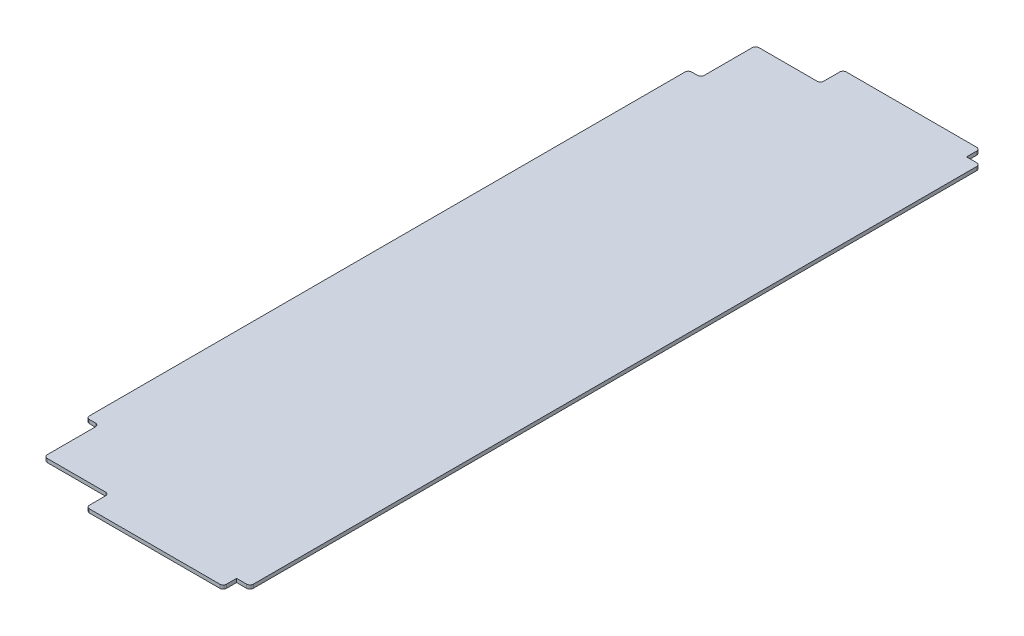
ISO-10303-21;
HEADER;
FILE_DESCRIPTION(('STEP AP214'),'2;1');
FILE_NAME('part.step','',(''),(''),'','','');
FILE_SCHEMA(('AUTOMOTIVE_DESIGN { 1 0 10303 214 1 1 1 1 }'));
ENDSEC;
DATA;
#1=APPLICATION_CONTEXT('core data for automotive mechanical design processes');
#2=APPLICATION_PROTOCOL_DEFINITION('international standard','automotive_design',2000,#1);
#3=PRODUCT_CONTEXT('',#1,'mechanical');
#4=PRODUCT('Part','Part','',(#3));
#5=PRODUCT_RELATED_PRODUCT_CATEGORY('part','',(#4));
#6=PRODUCT_DEFINITION_FORMATION('','',#4);
#7=PRODUCT_DEFINITION_CONTEXT('part definition',#1,'design');
#8=PRODUCT_DEFINITION('design','',#6,#7);
#9=PRODUCT_DEFINITION_SHAPE('','',#8);
#10=(LENGTH_UNIT() NAMED_UNIT(*) SI_UNIT(.MILLI.,.METRE.));
#11=(NAMED_UNIT(*) PLANE_ANGLE_UNIT() SI_UNIT($,.RADIAN.));
#12=(NAMED_UNIT(*) SI_UNIT($,.STERADIAN.) SOLID_ANGLE_UNIT());
#13=UNCERTAINTY_MEASURE_WITH_UNIT(LENGTH_MEASURE(1.E-05),#10,'distance_accuracy_value','');
#14=(GEOMETRIC_REPRESENTATION_CONTEXT(3) GLOBAL_UNCERTAINTY_ASSIGNED_CONTEXT((#13)) GLOBAL_UNIT_ASSIGNED_CONTEXT((#10,
#11,#12)) REPRESENTATION_CONTEXT('',''));
#15=CARTESIAN_POINT('',(0.,0.,0.));
#16=DIRECTION('',(0.,0.,1.));
#17=DIRECTION('',(1.,0.,0.));
#18=AXIS2_PLACEMENT_3D('',#15,#16,#17);
#19=CARTESIAN_POINT('',(190.5,2.778125,0.));
#20=DIRECTION('',(-1.,0.,0.));
#21=DIRECTION('',(0.,0.,1.));
#22=AXIS2_PLACEMENT_3D('',#19,#20,#21);
#23=PLANE('',#22);
#24=DIRECTION('',(0.,0.,-1.));
#25=VECTOR('',#24,1.);
#26=CARTESIAN_POINT('',(190.5,2.778125,0.));
#27=LINE('',#26,#25);
#28=CARTESIAN_POINT('',(190.5,2.778125,-30.48));
#29=VERTEX_POINT('',#28);
#30=CARTESIAN_POINT('',(190.5,2.778125,-579.12));
#31=VERTEX_POINT('',#30);
#32=EDGE_CURVE('E336',#29,#31,#27,.T.);
#33=ORIENTED_EDGE('',*,*,#32,.F.);
#34=DIRECTION('',(0.,1.,0.));
#35=VECTOR('',#34,1.);
#36=CARTESIAN_POINT('',(190.5,2.778125,-30.48));
#37=LINE('',#36,#35);
#38=CARTESIAN_POINT('',(190.5,0.,-30.48));
#39=VERTEX_POINT('',#38);
#40=EDGE_CURVE('E376',#29,#39,#37,.F.);
#41=ORIENTED_EDGE('',*,*,#40,.T.);
#42=DIRECTION('',(0.,0.,-1.));
#43=VECTOR('',#42,1.);
#44=CARTESIAN_POINT('',(190.5,0.,0.));
#45=LINE('',#44,#43);
#46=CARTESIAN_POINT('',(190.5,0.,-579.12));
#47=VERTEX_POINT('',#46);
#48=EDGE_CURVE('E327',#39,#47,#45,.T.);
#49=ORIENTED_EDGE('',*,*,#48,.T.);
#50=DIRECTION('',(0.,1.,0.));
#51=VECTOR('',#50,1.);
#52=CARTESIAN_POINT('',(190.5,2.778125,-579.12));
#53=LINE('',#52,#51);
#54=EDGE_CURVE('E373',#47,#31,#53,.T.);
#55=ORIENTED_EDGE('',*,*,#54,.T.);
#56=EDGE_LOOP('',(#33,#41,#49,#55));
#57=FACE_BOUND('',#56,.T.);
#58=ADVANCED_FACE('F32',(#57),#23,.F.);
#59=CARTESIAN_POINT('',(0.,2.778125,0.));
#60=DIRECTION('',(0.,-1.,0.));
#61=DIRECTION('',(0.,0.,-1.));
#62=AXIS2_PLACEMENT_3D('',#59,#60,#61);
#63=PLANE('',#62);
#64=DIRECTION('',(-1.,0.,0.));
#65=VECTOR('',#64,1.);
#66=CARTESIAN_POINT('',(190.5,2.778125,-27.94));
#67=LINE('',#66,#65);
#68=CARTESIAN_POINT('',(187.96,2.778125,-27.94));
#69=VERTEX_POINT('',#68);
#70=CARTESIAN_POINT('',(180.34,2.778125,-27.94));
#71=VERTEX_POINT('',#70);
#72=EDGE_CURVE('E247',#69,#71,#67,.T.);
#73=ORIENTED_EDGE('',*,*,#72,.F.);
#74=CARTESIAN_POINT('',(187.96,2.778125,-30.48));
#75=DIRECTION('',(0.,-1.,0.));
#76=DIRECTION('',(0.,0.,-1.));
#77=AXIS2_PLACEMENT_3D('',#74,#75,#76);
#78=CIRCLE('',#77,2.54);
#79=EDGE_CURVE('E371',#69,#29,#78,.F.);
#80=ORIENTED_EDGE('',*,*,#79,.T.);
#81=ORIENTED_EDGE('',*,*,#32,.T.);
#82=CARTESIAN_POINT('',(187.96,2.778125,-579.12));
#83=DIRECTION('',(0.,-1.,0.));
#84=DIRECTION('',(0.,0.,-1.));
#85=AXIS2_PLACEMENT_3D('',#82,#83,#84);
#86=CIRCLE('',#85,2.54);
#87=CARTESIAN_POINT('',(187.96,2.778125,-581.66));
#88=VERTEX_POINT('',#87);
#89=EDGE_CURVE('E365',#31,#88,#86,.F.);
#90=ORIENTED_EDGE('',*,*,#89,.T.);
#91=DIRECTION('',(1.,0.,0.));
#92=VECTOR('',#91,1.);
#93=CARTESIAN_POINT('',(190.5,2.778125,-581.66));
#94=LINE('',#93,#92);
#95=CARTESIAN_POINT('',(180.34,2.778125,-581.66));
#96=VERTEX_POINT('',#95);
#97=EDGE_CURVE('E286',#96,#88,#94,.T.);
#98=ORIENTED_EDGE('',*,*,#97,.F.);
#99=DIRECTION('',(0.,0.,1.));
#100=VECTOR('',#99,1.);
#101=CARTESIAN_POINT('',(180.34,2.778125,-591.82));
#102=LINE('',#101,#100);
#103=CARTESIAN_POINT('',(180.34,2.778125,-589.28));
#104=VERTEX_POINT('',#103);
#105=EDGE_CURVE('E251',#104,#96,#102,.T.);
#106=ORIENTED_EDGE('',*,*,#105,.F.);
#107=CARTESIAN_POINT('',(177.8,2.778125,-589.28));
#108=DIRECTION('',(0.,-1.,0.));
#109=DIRECTION('',(0.,0.,-1.));
#110=AXIS2_PLACEMENT_3D('',#107,#108,#109);
#111=CIRCLE('',#110,2.54);
#112=CARTESIAN_POINT('',(177.8,2.778125,-591.82));
#113=VERTEX_POINT('',#112);
#114=EDGE_CURVE('E367',#104,#113,#111,.F.);
#115=ORIENTED_EDGE('',*,*,#114,.T.);
#116=DIRECTION('',(1.,0.,0.));
#117=VECTOR('',#116,1.);
#118=CARTESIAN_POINT('',(0.,2.778125,-591.82));
#119=LINE('',#118,#117);
#120=CARTESIAN_POINT('',(78.994,2.778125,-591.82));
#121=VERTEX_POINT('',#120);
#122=EDGE_CURVE('E321',#121,#113,#119,.T.);
#123=ORIENTED_EDGE('',*,*,#122,.F.);
#124=CARTESIAN_POINT('',(78.994,2.778125,-589.28));
#125=DIRECTION('',(0.,-1.,0.));
#126=DIRECTION('',(0.,0.,-1.));
#127=AXIS2_PLACEMENT_3D('',#124,#125,#126);
#128=CIRCLE('',#127,2.54);
#129=CARTESIAN_POINT('',(76.454,2.778125,-589.28));
#130=VERTEX_POINT('',#129);
#131=EDGE_CURVE('E355',#121,#130,#128,.F.);
#132=ORIENTED_EDGE('',*,*,#131,.T.);
#133=DIRECTION('',(0.,0.,-1.));
#134=VECTOR('',#133,1.);
#135=CARTESIAN_POINT('',(76.454,2.778125,-591.82));
#136=LINE('',#135,#134);
#137=CARTESIAN_POINT('',(76.454,2.778125,-577.215));
#138=VERTEX_POINT('',#137);
#139=EDGE_CURVE('E298',#138,#130,#136,.T.);
#140=ORIENTED_EDGE('',*,*,#139,.F.);
#141=CARTESIAN_POINT('',(73.914,2.778125,-577.215));
#142=DIRECTION('',(0.,-1.,0.));
#143=DIRECTION('',(0.,0.,-1.));
#144=AXIS2_PLACEMENT_3D('',#141,#142,#143);
#145=CIRCLE('',#144,2.54);
#146=CARTESIAN_POINT('',(73.914,2.778125,-574.675));
#147=VERTEX_POINT('',#146);
#148=EDGE_CURVE('E40',#138,#147,#145,.T.);
#149=ORIENTED_EDGE('',*,*,#148,.T.);
#150=DIRECTION('',(1.,0.,0.));
#151=VECTOR('',#150,1.);
#152=CARTESIAN_POINT('',(76.454,2.778125,-574.675));
#153=LINE('',#152,#151);
#154=CARTESIAN_POINT('',(29.845,2.778125,-574.675));
#155=VERTEX_POINT('',#154);
#156=EDGE_CURVE('E313',#155,#147,#153,.T.);
#157=ORIENTED_EDGE('',*,*,#156,.F.);
#158=CARTESIAN_POINT('',(29.845,2.778125,-572.135));
#159=DIRECTION('',(0.,-1.,0.));
#160=DIRECTION('',(0.,0.,-1.));
#161=AXIS2_PLACEMENT_3D('',#158,#159,#160);
#162=CIRCLE('',#161,2.54);
#163=CARTESIAN_POINT('',(27.305,2.778125,-572.135));
#164=VERTEX_POINT('',#163);
#165=EDGE_CURVE('E353',#155,#164,#162,.F.);
#166=ORIENTED_EDGE('',*,*,#165,.T.);
#167=DIRECTION('',(0.,0.,-1.));
#168=VECTOR('',#167,1.);
#169=CARTESIAN_POINT('',(27.305,2.778125,-574.675));
#170=LINE('',#169,#168);
#171=CARTESIAN_POINT('',(27.305,2.778125,-535.686));
#172=VERTEX_POINT('',#171);
#173=EDGE_CURVE('E310',#172,#164,#170,.T.);
#174=ORIENTED_EDGE('',*,*,#173,.F.);
#175=CARTESIAN_POINT('',(24.765,2.778125,-535.686));
#176=DIRECTION('',(0.,-1.,0.));
#177=DIRECTION('',(0.,0.,-1.));
#178=AXIS2_PLACEMENT_3D('',#175,#176,#177);
#179=CIRCLE('',#178,2.54);
#180=CARTESIAN_POINT('',(24.765,2.778125,-533.146));
#181=VERTEX_POINT('',#180);
#182=EDGE_CURVE('E446',#172,#181,#179,.T.);
#183=ORIENTED_EDGE('',*,*,#182,.T.);
#184=DIRECTION('',(1.,0.,0.));
#185=VECTOR('',#184,1.);
#186=CARTESIAN_POINT('',(27.305,2.778125,-533.146));
#187=LINE('',#186,#185);
#188=CARTESIAN_POINT('',(20.32,2.778125,-533.146));
#189=VERTEX_POINT('',#188);
#190=EDGE_CURVE('E271',#189,#181,#187,.T.);
#191=ORIENTED_EDGE('',*,*,#190,.F.);
#192=CARTESIAN_POINT('',(20.32,2.778125,-530.606));
#193=DIRECTION('',(0.,-1.,0.));
#194=DIRECTION('',(0.,0.,-1.));
#195=AXIS2_PLACEMENT_3D('',#192,#193,#194);
#196=CIRCLE('',#195,2.54);
#197=CARTESIAN_POINT('',(17.78,2.778125,-530.606));
#198=VERTEX_POINT('',#197);
#199=EDGE_CURVE('E357',#189,#198,#196,.F.);
#200=ORIENTED_EDGE('',*,*,#199,.T.);
#201=DIRECTION('',(0.,0.,-1.));
#202=VECTOR('',#201,1.);
#203=CARTESIAN_POINT('',(17.78,2.778125,-591.82));
#204=LINE('',#203,#202);
#205=CARTESIAN_POINT('',(17.78,2.778125,-78.994));
#206=VERTEX_POINT('',#205);
#207=EDGE_CURVE('E307',#206,#198,#204,.T.);
#208=ORIENTED_EDGE('',*,*,#207,.F.);
#209=CARTESIAN_POINT('',(20.32,2.778125,-78.994));
#210=DIRECTION('',(0.,-1.,0.));
#211=DIRECTION('',(0.,0.,-1.));
#212=AXIS2_PLACEMENT_3D('',#209,#210,#211);
#213=CIRCLE('',#212,2.54);
#214=CARTESIAN_POINT('',(20.32,2.778125,-76.454));
#215=VERTEX_POINT('',#214);
#216=EDGE_CURVE('E359',#206,#215,#213,.F.);
#217=ORIENTED_EDGE('',*,*,#216,.T.);
#218=DIRECTION('',(-1.,0.,0.));
#219=VECTOR('',#218,1.);
#220=CARTESIAN_POINT('',(27.3050000000001,2.778125,-76.454));
#221=LINE('',#220,#219);
#222=CARTESIAN_POINT('',(24.7650000000001,2.778125,-76.454));
#223=VERTEX_POINT('',#222);
#224=EDGE_CURVE('E264',#223,#215,#221,.T.);
#225=ORIENTED_EDGE('',*,*,#224,.F.);
#226=CARTESIAN_POINT('',(24.7650000000001,2.778125,-73.914));
#227=DIRECTION('',(0.,-1.,0.));
#228=DIRECTION('',(0.,0.,-1.));
#229=AXIS2_PLACEMENT_3D('',#226,#227,#228);
#230=CIRCLE('',#229,2.54);
#231=CARTESIAN_POINT('',(27.3050000000001,2.778125,-73.914));
#232=VERTEX_POINT('',#231);
#233=EDGE_CURVE('E454',#223,#232,#230,.T.);
#234=ORIENTED_EDGE('',*,*,#233,.T.);
#235=DIRECTION('',(0.,0.,-1.));
#236=VECTOR('',#235,1.);
#237=CARTESIAN_POINT('',(27.3050000000001,2.778125,-34.925));
#238=LINE('',#237,#236);
#239=CARTESIAN_POINT('',(27.3050000000001,2.778125,-37.465));
#240=VERTEX_POINT('',#239);
#241=EDGE_CURVE('E279',#240,#232,#238,.T.);
#242=ORIENTED_EDGE('',*,*,#241,.F.);
#243=CARTESIAN_POINT('',(29.8450000000001,2.778125,-37.465));
#244=DIRECTION('',(0.,-1.,0.));
#245=DIRECTION('',(0.,0.,-1.));
#246=AXIS2_PLACEMENT_3D('',#243,#244,#245);
#247=CIRCLE('',#246,2.54);
#248=CARTESIAN_POINT('',(29.8450000000001,2.778125,-34.925));
#249=VERTEX_POINT('',#248);
#250=EDGE_CURVE('E361',#240,#249,#247,.F.);
#251=ORIENTED_EDGE('',*,*,#250,.T.);
#252=DIRECTION('',(-1.,0.,0.));
#253=VECTOR('',#252,1.);
#254=CARTESIAN_POINT('',(76.454,2.778125,-34.925));
#255=LINE('',#254,#253);
#256=CARTESIAN_POINT('',(73.914,2.778125,-34.925));
#257=VERTEX_POINT('',#256);
#258=EDGE_CURVE('E275',#257,#249,#255,.T.);
#259=ORIENTED_EDGE('',*,*,#258,.F.);
#260=CARTESIAN_POINT('',(73.914,2.778125,-32.385));
#261=DIRECTION('',(0.,-1.,0.));
#262=DIRECTION('',(0.,0.,-1.));
#263=AXIS2_PLACEMENT_3D('',#260,#261,#262);
#264=CIRCLE('',#263,2.54);
#265=CARTESIAN_POINT('',(76.454,2.778125,-32.385));
#266=VERTEX_POINT('',#265);
#267=EDGE_CURVE('E450',#257,#266,#264,.T.);
#268=ORIENTED_EDGE('',*,*,#267,.T.);
#269=DIRECTION('',(0.,0.,-1.));
#270=VECTOR('',#269,1.);
#271=CARTESIAN_POINT('',(76.454,2.778125,-17.78));
#272=LINE('',#271,#270);
#273=CARTESIAN_POINT('',(76.454,2.778125,-20.32));
#274=VERTEX_POINT('',#273);
#275=EDGE_CURVE('E272',#274,#266,#272,.T.);
#276=ORIENTED_EDGE('',*,*,#275,.F.);
#277=CARTESIAN_POINT('',(78.994,2.778125,-20.32));
#278=DIRECTION('',(0.,-1.,0.));
#279=DIRECTION('',(0.,0.,-1.));
#280=AXIS2_PLACEMENT_3D('',#277,#278,#279);
#281=CIRCLE('',#280,2.54);
#282=CARTESIAN_POINT('',(78.994,2.778125,-17.78));
#283=VERTEX_POINT('',#282);
#284=EDGE_CURVE('E363',#274,#283,#281,.F.);
#285=ORIENTED_EDGE('',*,*,#284,.T.);
#286=DIRECTION('',(-1.,0.,0.));
#287=VECTOR('',#286,1.);
#288=CARTESIAN_POINT('',(0.,2.778125,-17.78));
#289=LINE('',#288,#287);
#290=CARTESIAN_POINT('',(177.8,2.778125,-17.78));
#291=VERTEX_POINT('',#290);
#292=EDGE_CURVE('E328',#291,#283,#289,.T.);
#293=ORIENTED_EDGE('',*,*,#292,.F.);
#294=CARTESIAN_POINT('',(177.8,2.778125,-20.32));
#295=DIRECTION('',(0.,-1.,0.));
#296=DIRECTION('',(0.,0.,-1.));
#297=AXIS2_PLACEMENT_3D('',#294,#295,#296);
#298=CIRCLE('',#297,2.54);
#299=CARTESIAN_POINT('',(180.34,2.778125,-20.32));
#300=VERTEX_POINT('',#299);
#301=EDGE_CURVE('E369',#291,#300,#298,.F.);
#302=ORIENTED_EDGE('',*,*,#301,.T.);
#303=DIRECTION('',(0.,0.,1.));
#304=VECTOR('',#303,1.);
#305=CARTESIAN_POINT('',(180.34,2.778125,-17.78));
#306=LINE('',#305,#304);
#307=EDGE_CURVE('E241',#71,#300,#306,.T.);
#308=ORIENTED_EDGE('',*,*,#307,.F.);
#309=EDGE_LOOP('',(#73,#80,#81,#90,#98,#106,#115,#123,#132,#140,#149,#157,#166,#174,#183,#191,
#200,#208,#217,#225,#234,#242,#251,#259,#268,#276,#285,#293,#302,#308));
#310=FACE_BOUND('',#309,.T.);
#311=ADVANCED_FACE('F460',(#310),#63,.F.);
#312=CARTESIAN_POINT('',(0.,0.,0.));
#313=DIRECTION('',(0.,-1.,0.));
#314=DIRECTION('',(0.,0.,-1.));
#315=AXIS2_PLACEMENT_3D('',#312,#313,#314);
#316=PLANE('',#315);
#317=ORIENTED_EDGE('',*,*,#48,.F.);
#318=CARTESIAN_POINT('',(187.96,0.,-30.48));
#319=DIRECTION('',(0.,-1.,0.));
#320=DIRECTION('',(0.,0.,-1.));
#321=AXIS2_PLACEMENT_3D('',#318,#319,#320);
#322=CIRCLE('',#321,2.54);
#323=CARTESIAN_POINT('',(187.96,0.,-27.94));
#324=VERTEX_POINT('',#323);
#325=EDGE_CURVE('E237',#39,#324,#322,.T.);
#326=ORIENTED_EDGE('',*,*,#325,.T.);
#327=DIRECTION('',(-1.,0.,0.));
#328=VECTOR('',#327,1.);
#329=CARTESIAN_POINT('',(190.5,0.,-27.94));
#330=LINE('',#329,#328);
#331=CARTESIAN_POINT('',(180.34,0.,-27.94));
#332=VERTEX_POINT('',#331);
#333=EDGE_CURVE('E229',#324,#332,#330,.T.);
#334=ORIENTED_EDGE('',*,*,#333,.T.);
#335=DIRECTION('',(0.,0.,1.));
#336=VECTOR('',#335,1.);
#337=CARTESIAN_POINT('',(180.34,0.,-17.78));
#338=LINE('',#337,#336);
#339=CARTESIAN_POINT('',(180.34,0.,-20.32));
#340=VERTEX_POINT('',#339);
#341=EDGE_CURVE('E234',#332,#340,#338,.T.);
#342=ORIENTED_EDGE('',*,*,#341,.T.);
#343=CARTESIAN_POINT('',(177.8,0.,-20.32));
#344=DIRECTION('',(0.,-1.,0.));
#345=DIRECTION('',(0.,0.,-1.));
#346=AXIS2_PLACEMENT_3D('',#343,#344,#345);
#347=CIRCLE('',#346,2.54);
#348=CARTESIAN_POINT('',(177.8,0.,-17.78));
#349=VERTEX_POINT('',#348);
#350=EDGE_CURVE('E393',#340,#349,#347,.T.);
#351=ORIENTED_EDGE('',*,*,#350,.T.);
#352=DIRECTION('',(-1.,0.,0.));
#353=VECTOR('',#352,1.);
#354=CARTESIAN_POINT('',(0.,0.,-17.78));
#355=LINE('',#354,#353);
#356=CARTESIAN_POINT('',(78.994,0.,-17.78));
#357=VERTEX_POINT('',#356);
#358=EDGE_CURVE('E324',#349,#357,#355,.T.);
#359=ORIENTED_EDGE('',*,*,#358,.T.);
#360=CARTESIAN_POINT('',(78.994,0.,-20.32));
#361=DIRECTION('',(0.,-1.,0.));
#362=DIRECTION('',(0.,0.,-1.));
#363=AXIS2_PLACEMENT_3D('',#360,#361,#362);
#364=CIRCLE('',#363,2.54);
#365=CARTESIAN_POINT('',(76.454,0.,-20.32));
#366=VERTEX_POINT('',#365);
#367=EDGE_CURVE('E387',#357,#366,#364,.T.);
#368=ORIENTED_EDGE('',*,*,#367,.T.);
#369=DIRECTION('',(0.,0.,-1.));
#370=VECTOR('',#369,1.);
#371=CARTESIAN_POINT('',(76.454,0.,-17.78));
#372=LINE('',#371,#370);
#373=CARTESIAN_POINT('',(76.454,0.,-32.385));
#374=VERTEX_POINT('',#373);
#375=EDGE_CURVE('E260',#366,#374,#372,.T.);
#376=ORIENTED_EDGE('',*,*,#375,.T.);
#377=CARTESIAN_POINT('',(73.914,0.,-32.385));
#378=DIRECTION('',(0.,-1.,0.));
#379=DIRECTION('',(0.,0.,-1.));
#380=AXIS2_PLACEMENT_3D('',#377,#378,#379);
#381=CIRCLE('',#380,2.54);
#382=CARTESIAN_POINT('',(73.914,0.,-34.925));
#383=VERTEX_POINT('',#382);
#384=EDGE_CURVE('E452',#374,#383,#381,.F.);
#385=ORIENTED_EDGE('',*,*,#384,.T.);
#386=DIRECTION('',(-1.,0.,0.));
#387=VECTOR('',#386,1.);
#388=CARTESIAN_POINT('',(76.454,0.,-34.925));
#389=LINE('',#388,#387);
#390=CARTESIAN_POINT('',(29.8450000000001,0.,-34.925));
#391=VERTEX_POINT('',#390);
#392=EDGE_CURVE('E263',#383,#391,#389,.T.);
#393=ORIENTED_EDGE('',*,*,#392,.T.);
#394=CARTESIAN_POINT('',(29.8450000000001,0.,-37.465));
#395=DIRECTION('',(0.,-1.,0.));
#396=DIRECTION('',(0.,0.,-1.));
#397=AXIS2_PLACEMENT_3D('',#394,#395,#396);
#398=CIRCLE('',#397,2.54);
#399=CARTESIAN_POINT('',(27.3050000000001,0.,-37.465));
#400=VERTEX_POINT('',#399);
#401=EDGE_CURVE('E54',#391,#400,#398,.T.);
#402=ORIENTED_EDGE('',*,*,#401,.T.);
#403=DIRECTION('',(0.,0.,-1.));
#404=VECTOR('',#403,1.);
#405=CARTESIAN_POINT('',(27.3050000000001,0.,-34.925));
#406=LINE('',#405,#404);
#407=CARTESIAN_POINT('',(27.3050000000001,0.,-73.914));
#408=VERTEX_POINT('',#407);
#409=EDGE_CURVE('E266',#400,#408,#406,.T.);
#410=ORIENTED_EDGE('',*,*,#409,.T.);
#411=CARTESIAN_POINT('',(24.7650000000001,0.,-73.914));
#412=DIRECTION('',(0.,-1.,0.));
#413=DIRECTION('',(0.,0.,-1.));
#414=AXIS2_PLACEMENT_3D('',#411,#412,#413);
#415=CIRCLE('',#414,2.54);
#416=CARTESIAN_POINT('',(24.7650000000001,0.,-76.454));
#417=VERTEX_POINT('',#416);
#418=EDGE_CURVE('E456',#408,#417,#415,.F.);
#419=ORIENTED_EDGE('',*,*,#418,.T.);
#420=DIRECTION('',(-1.,0.,0.));
#421=VECTOR('',#420,1.);
#422=CARTESIAN_POINT('',(27.3050000000001,0.,-76.454));
#423=LINE('',#422,#421);
#424=CARTESIAN_POINT('',(20.32,0.,-76.454));
#425=VERTEX_POINT('',#424);
#426=EDGE_CURVE('E268',#417,#425,#423,.T.);
#427=ORIENTED_EDGE('',*,*,#426,.T.);
#428=CARTESIAN_POINT('',(20.32,0.,-78.994));
#429=DIRECTION('',(0.,-1.,0.));
#430=DIRECTION('',(0.,0.,-1.));
#431=AXIS2_PLACEMENT_3D('',#428,#429,#430);
#432=CIRCLE('',#431,2.54);
#433=CARTESIAN_POINT('',(17.78,0.,-78.994));
#434=VERTEX_POINT('',#433);
#435=EDGE_CURVE('E384',#425,#434,#432,.T.);
#436=ORIENTED_EDGE('',*,*,#435,.T.);
#437=DIRECTION('',(0.,0.,-1.));
#438=VECTOR('',#437,1.);
#439=CARTESIAN_POINT('',(17.78,0.,-591.82));
#440=LINE('',#439,#438);
#441=CARTESIAN_POINT('',(17.78,0.,-530.606));
#442=VERTEX_POINT('',#441);
#443=EDGE_CURVE('E318',#434,#442,#440,.T.);
#444=ORIENTED_EDGE('',*,*,#443,.T.);
#445=CARTESIAN_POINT('',(20.32,0.,-530.606));
#446=DIRECTION('',(0.,-1.,0.));
#447=DIRECTION('',(0.,0.,-1.));
#448=AXIS2_PLACEMENT_3D('',#445,#446,#447);
#449=CIRCLE('',#448,2.54);
#450=CARTESIAN_POINT('',(20.32,0.,-533.146));
#451=VERTEX_POINT('',#450);
#452=EDGE_CURVE('E382',#442,#451,#449,.T.);
#453=ORIENTED_EDGE('',*,*,#452,.T.);
#454=DIRECTION('',(1.,0.,0.));
#455=VECTOR('',#454,1.);
#456=CARTESIAN_POINT('',(27.305,0.,-533.146));
#457=LINE('',#456,#455);
#458=CARTESIAN_POINT('',(24.765,0.,-533.146));
#459=VERTEX_POINT('',#458);
#460=EDGE_CURVE('E294',#451,#459,#457,.T.);
#461=ORIENTED_EDGE('',*,*,#460,.T.);
#462=CARTESIAN_POINT('',(24.765,0.,-535.686));
#463=DIRECTION('',(0.,-1.,0.));
#464=DIRECTION('',(0.,0.,-1.));
#465=AXIS2_PLACEMENT_3D('',#462,#463,#464);
#466=CIRCLE('',#465,2.54);
#467=CARTESIAN_POINT('',(27.305,0.,-535.686));
#468=VERTEX_POINT('',#467);
#469=EDGE_CURVE('E448',#459,#468,#466,.F.);
#470=ORIENTED_EDGE('',*,*,#469,.T.);
#471=DIRECTION('',(0.,0.,-1.));
#472=VECTOR('',#471,1.);
#473=CARTESIAN_POINT('',(27.305,0.,-574.675));
#474=LINE('',#473,#472);
#475=CARTESIAN_POINT('',(27.305,0.,-572.135));
#476=VERTEX_POINT('',#475);
#477=EDGE_CURVE('E297',#468,#476,#474,.T.);
#478=ORIENTED_EDGE('',*,*,#477,.T.);
#479=CARTESIAN_POINT('',(29.845,0.,-572.135));
#480=DIRECTION('',(0.,-1.,0.));
#481=DIRECTION('',(0.,0.,-1.));
#482=AXIS2_PLACEMENT_3D('',#479,#480,#481);
#483=CIRCLE('',#482,2.54);
#484=CARTESIAN_POINT('',(29.845,0.,-574.675));
#485=VERTEX_POINT('',#484);
#486=EDGE_CURVE('E378',#476,#485,#483,.T.);
#487=ORIENTED_EDGE('',*,*,#486,.T.);
#488=DIRECTION('',(1.,0.,0.));
#489=VECTOR('',#488,1.);
#490=CARTESIAN_POINT('',(76.454,0.,-574.675));
#491=LINE('',#490,#489);
#492=CARTESIAN_POINT('',(73.914,0.,-574.675));
#493=VERTEX_POINT('',#492);
#494=EDGE_CURVE('E301',#485,#493,#491,.T.);
#495=ORIENTED_EDGE('',*,*,#494,.T.);
#496=CARTESIAN_POINT('',(73.914,0.,-577.215));
#497=DIRECTION('',(0.,-1.,0.));
#498=DIRECTION('',(0.,0.,-1.));
#499=AXIS2_PLACEMENT_3D('',#496,#497,#498);
#500=CIRCLE('',#499,2.54);
#501=CARTESIAN_POINT('',(76.454,0.,-577.215));
#502=VERTEX_POINT('',#501);
#503=EDGE_CURVE('E11',#493,#502,#500,.F.);
#504=ORIENTED_EDGE('',*,*,#503,.T.);
#505=DIRECTION('',(0.,0.,-1.));
#506=VECTOR('',#505,1.);
#507=CARTESIAN_POINT('',(76.454,0.,-591.82));
#508=LINE('',#507,#506);
#509=CARTESIAN_POINT('',(76.454,0.,-589.28));
#510=VERTEX_POINT('',#509);
#511=EDGE_CURVE('E304',#502,#510,#508,.T.);
#512=ORIENTED_EDGE('',*,*,#511,.T.);
#513=CARTESIAN_POINT('',(78.994,0.,-589.28));
#514=DIRECTION('',(0.,-1.,0.));
#515=DIRECTION('',(0.,0.,-1.));
#516=AXIS2_PLACEMENT_3D('',#513,#514,#515);
#517=CIRCLE('',#516,2.54);
#518=CARTESIAN_POINT('',(78.994,0.,-591.82));
#519=VERTEX_POINT('',#518);
#520=EDGE_CURVE('E380',#510,#519,#517,.T.);
#521=ORIENTED_EDGE('',*,*,#520,.T.);
#522=DIRECTION('',(1.,0.,0.));
#523=VECTOR('',#522,1.);
#524=CARTESIAN_POINT('',(0.,0.,-591.82));
#525=LINE('',#524,#523);
#526=CARTESIAN_POINT('',(177.8,0.,-591.82));
#527=VERTEX_POINT('',#526);
#528=EDGE_CURVE('E331',#519,#527,#525,.T.);
#529=ORIENTED_EDGE('',*,*,#528,.T.);
#530=CARTESIAN_POINT('',(177.8,0.,-589.28));
#531=DIRECTION('',(0.,-1.,0.));
#532=DIRECTION('',(0.,0.,-1.));
#533=AXIS2_PLACEMENT_3D('',#530,#531,#532);
#534=CIRCLE('',#533,2.54);
#535=CARTESIAN_POINT('',(180.34,0.,-589.28));
#536=VERTEX_POINT('',#535);
#537=EDGE_CURVE('E391',#527,#536,#534,.T.);
#538=ORIENTED_EDGE('',*,*,#537,.T.);
#539=DIRECTION('',(0.,0.,1.));
#540=VECTOR('',#539,1.);
#541=CARTESIAN_POINT('',(180.34,0.,-591.82));
#542=LINE('',#541,#540);
#543=CARTESIAN_POINT('',(180.34,0.,-581.66));
#544=VERTEX_POINT('',#543);
#545=EDGE_CURVE('E283',#536,#544,#542,.T.);
#546=ORIENTED_EDGE('',*,*,#545,.T.);
#547=DIRECTION('',(1.,0.,0.));
#548=VECTOR('',#547,1.);
#549=CARTESIAN_POINT('',(190.5,0.,-581.66));
#550=LINE('',#549,#548);
#551=CARTESIAN_POINT('',(187.96,0.,-581.66));
#552=VERTEX_POINT('',#551);
#553=EDGE_CURVE('E285',#544,#552,#550,.T.);
#554=ORIENTED_EDGE('',*,*,#553,.T.);
#555=CARTESIAN_POINT('',(187.96,0.,-579.12));
#556=DIRECTION('',(0.,-1.,0.));
#557=DIRECTION('',(0.,0.,-1.));
#558=AXIS2_PLACEMENT_3D('',#555,#556,#557);
#559=CIRCLE('',#558,2.54);
#560=EDGE_CURVE('E389',#552,#47,#559,.T.);
#561=ORIENTED_EDGE('',*,*,#560,.T.);
#562=EDGE_LOOP('',(#317,#326,#334,#342,#351,#359,#368,#376,#385,#393,#402,#410,#419,#427,#436,
#444,#453,#461,#470,#478,#487,#495,#504,#512,#521,#529,#538,#546,#554,#561));
#563=FACE_BOUND('',#562,.T.);
#564=ADVANCED_FACE('F232',(#563),#316,.T.);
#565=CARTESIAN_POINT('',(0.,0.,-591.82));
#566=DIRECTION('',(0.,0.,1.));
#567=DIRECTION('',(1.,0.,0.));
#568=AXIS2_PLACEMENT_3D('',#565,#566,#567);
#569=PLANE('',#568);
#570=ORIENTED_EDGE('',*,*,#122,.T.);
#571=DIRECTION('',(0.,1.,0.));
#572=VECTOR('',#571,1.);
#573=CARTESIAN_POINT('',(177.8,0.,-591.82));
#574=LINE('',#573,#572);
#575=EDGE_CURVE('E408',#113,#527,#574,.F.);
#576=ORIENTED_EDGE('',*,*,#575,.T.);
#577=ORIENTED_EDGE('',*,*,#528,.F.);
#578=DIRECTION('',(0.,1.,0.));
#579=VECTOR('',#578,1.);
#580=CARTESIAN_POINT('',(78.994,0.,-591.82));
#581=LINE('',#580,#579);
#582=EDGE_CURVE('E405',#519,#121,#581,.T.);
#583=ORIENTED_EDGE('',*,*,#582,.T.);
#584=EDGE_LOOP('',(#570,#576,#577,#583));
#585=FACE_BOUND('',#584,.T.);
#586=ADVANCED_FACE('F481',(#585),#569,.F.);
#587=CARTESIAN_POINT('',(0.,0.,-17.78));
#588=DIRECTION('',(0.,0.,-1.));
#589=DIRECTION('',(-1.,0.,0.));
#590=AXIS2_PLACEMENT_3D('',#587,#588,#589);
#591=PLANE('',#590);
#592=ORIENTED_EDGE('',*,*,#358,.F.);
#593=DIRECTION('',(0.,1.,0.));
#594=VECTOR('',#593,1.);
#595=CARTESIAN_POINT('',(177.8,0.,-17.78));
#596=LINE('',#595,#594);
#597=EDGE_CURVE('E398',#349,#291,#596,.T.);
#598=ORIENTED_EDGE('',*,*,#597,.T.);
#599=ORIENTED_EDGE('',*,*,#292,.T.);
#600=DIRECTION('',(0.,1.,0.));
#601=VECTOR('',#600,1.);
#602=CARTESIAN_POINT('',(78.994,0.,-17.78));
#603=LINE('',#602,#601);
#604=EDGE_CURVE('E396',#283,#357,#603,.F.);
#605=ORIENTED_EDGE('',*,*,#604,.T.);
#606=EDGE_LOOP('',(#592,#598,#599,#605));
#607=FACE_BOUND('',#606,.T.);
#608=ADVANCED_FACE('F529',(#607),#591,.F.);
#609=CARTESIAN_POINT('',(17.78,0.,-591.82));
#610=DIRECTION('',(1.,0.,0.));
#611=DIRECTION('',(0.,0.,-1.));
#612=AXIS2_PLACEMENT_3D('',#609,#610,#611);
#613=PLANE('',#612);
#614=ORIENTED_EDGE('',*,*,#443,.F.);
#615=DIRECTION('',(0.,1.,0.));
#616=VECTOR('',#615,1.);
#617=CARTESIAN_POINT('',(17.78,0.,-78.994));
#618=LINE('',#617,#616);
#619=EDGE_CURVE('E433',#434,#206,#618,.T.);
#620=ORIENTED_EDGE('',*,*,#619,.T.);
#621=ORIENTED_EDGE('',*,*,#207,.T.);
#622=DIRECTION('',(0.,1.,0.));
#623=VECTOR('',#622,1.);
#624=CARTESIAN_POINT('',(17.78,0.,-530.606));
#625=LINE('',#624,#623);
#626=EDGE_CURVE('E431',#198,#442,#625,.F.);
#627=ORIENTED_EDGE('',*,*,#626,.T.);
#628=EDGE_LOOP('',(#614,#620,#621,#627));
#629=FACE_BOUND('',#628,.T.);
#630=ADVANCED_FACE('F532',(#629),#613,.F.);
#631=CARTESIAN_POINT('',(76.454,0.,-591.82));
#632=DIRECTION('',(1.,0.,0.));
#633=DIRECTION('',(0.,0.,-1.));
#634=AXIS2_PLACEMENT_3D('',#631,#632,#633);
#635=PLANE('',#634);
#636=ORIENTED_EDGE('',*,*,#139,.T.);
#637=DIRECTION('',(0.,1.,0.));
#638=VECTOR('',#637,1.);
#639=CARTESIAN_POINT('',(76.454,0.,-589.28));
#640=LINE('',#639,#638);
#641=EDGE_CURVE('E439',#130,#510,#640,.F.);
#642=ORIENTED_EDGE('',*,*,#641,.T.);
#643=ORIENTED_EDGE('',*,*,#511,.F.);
#644=DIRECTION('',(0.,1.,0.));
#645=VECTOR('',#644,1.);
#646=CARTESIAN_POINT('',(76.454,2.778125,-577.215));
#647=LINE('',#646,#645);
#648=EDGE_CURVE('E436',#502,#138,#647,.T.);
#649=ORIENTED_EDGE('',*,*,#648,.T.);
#650=EDGE_LOOP('',(#636,#642,#643,#649));
#651=FACE_BOUND('',#650,.T.);
#652=ADVANCED_FACE('F473',(#651),#635,.F.);
#653=CARTESIAN_POINT('',(76.454,0.,-574.675));
#654=DIRECTION('',(0.,0.,1.));
#655=DIRECTION('',(1.,0.,0.));
#656=AXIS2_PLACEMENT_3D('',#653,#654,#655);
#657=PLANE('',#656);
#658=ORIENTED_EDGE('',*,*,#156,.T.);
#659=DIRECTION('',(0.,1.,0.));
#660=VECTOR('',#659,1.);
#661=CARTESIAN_POINT('',(73.914,0.,-574.675));
#662=LINE('',#661,#660);
#663=EDGE_CURVE('E444',#147,#493,#662,.F.);
#664=ORIENTED_EDGE('',*,*,#663,.T.);
#665=ORIENTED_EDGE('',*,*,#494,.F.);
#666=DIRECTION('',(0.,1.,0.));
#667=VECTOR('',#666,1.);
#668=CARTESIAN_POINT('',(29.845,0.,-574.675));
#669=LINE('',#668,#667);
#670=EDGE_CURVE('E441',#485,#155,#669,.T.);
#671=ORIENTED_EDGE('',*,*,#670,.T.);
#672=EDGE_LOOP('',(#658,#664,#665,#671));
#673=FACE_BOUND('',#672,.T.);
#674=ADVANCED_FACE('F465',(#673),#657,.F.);
#675=CARTESIAN_POINT('',(27.305,0.,-574.675));
#676=DIRECTION('',(1.,0.,0.));
#677=DIRECTION('',(0.,0.,-1.));
#678=AXIS2_PLACEMENT_3D('',#675,#676,#677);
#679=PLANE('',#678);
#680=ORIENTED_EDGE('',*,*,#477,.F.);
#681=DIRECTION('',(0.,1.,0.));
#682=VECTOR('',#681,1.);
#683=CARTESIAN_POINT('',(27.305,2.778125,-535.686));
#684=LINE('',#683,#682);
#685=EDGE_CURVE('E343',#468,#172,#684,.T.);
#686=ORIENTED_EDGE('',*,*,#685,.T.);
#687=ORIENTED_EDGE('',*,*,#173,.T.);
#688=DIRECTION('',(0.,1.,0.));
#689=VECTOR('',#688,1.);
#690=CARTESIAN_POINT('',(27.305,0.,-572.135));
#691=LINE('',#690,#689);
#692=EDGE_CURVE('E339',#164,#476,#691,.F.);
#693=ORIENTED_EDGE('',*,*,#692,.T.);
#694=EDGE_LOOP('',(#680,#686,#687,#693));
#695=FACE_BOUND('',#694,.T.);
#696=ADVANCED_FACE('F541',(#695),#679,.F.);
#697=CARTESIAN_POINT('',(27.305,0.,-533.146));
#698=DIRECTION('',(0.,0.,1.));
#699=DIRECTION('',(1.,0.,0.));
#700=AXIS2_PLACEMENT_3D('',#697,#698,#699);
#701=PLANE('',#700);
#702=ORIENTED_EDGE('',*,*,#190,.T.);
#703=DIRECTION('',(0.,1.,0.));
#704=VECTOR('',#703,1.);
#705=CARTESIAN_POINT('',(24.765,0.,-533.146));
#706=LINE('',#705,#704);
#707=EDGE_CURVE('E349',#181,#459,#706,.F.);
#708=ORIENTED_EDGE('',*,*,#707,.T.);
#709=ORIENTED_EDGE('',*,*,#460,.F.);
#710=DIRECTION('',(0.,1.,0.));
#711=VECTOR('',#710,1.);
#712=CARTESIAN_POINT('',(20.32,0.,-533.146));
#713=LINE('',#712,#711);
#714=EDGE_CURVE('E346',#451,#189,#713,.T.);
#715=ORIENTED_EDGE('',*,*,#714,.T.);
#716=EDGE_LOOP('',(#702,#708,#709,#715));
#717=FACE_BOUND('',#716,.T.);
#718=ADVANCED_FACE('F537',(#717),#701,.F.);
#719=CARTESIAN_POINT('',(27.3050000000001,0.,-76.454));
#720=DIRECTION('',(0.,0.,-1.));
#721=DIRECTION('',(-1.,0.,0.));
#722=AXIS2_PLACEMENT_3D('',#719,#720,#721);
#723=PLANE('',#722);
#724=ORIENTED_EDGE('',*,*,#426,.F.);
#725=DIRECTION('',(0.,1.,0.));
#726=VECTOR('',#725,1.);
#727=CARTESIAN_POINT('',(24.7650000000001,2.778125,-76.454));
#728=LINE('',#727,#726);
#729=EDGE_CURVE('E428',#417,#223,#728,.T.);
#730=ORIENTED_EDGE('',*,*,#729,.T.);
#731=ORIENTED_EDGE('',*,*,#224,.T.);
#732=DIRECTION('',(0.,1.,0.));
#733=VECTOR('',#732,1.);
#734=CARTESIAN_POINT('',(20.32,0.,-76.454));
#735=LINE('',#734,#733);
#736=EDGE_CURVE('E426',#215,#425,#735,.F.);
#737=ORIENTED_EDGE('',*,*,#736,.T.);
#738=EDGE_LOOP('',(#724,#730,#731,#737));
#739=FACE_BOUND('',#738,.T.);
#740=ADVANCED_FACE('F540',(#739),#723,.F.);
#741=CARTESIAN_POINT('',(27.3050000000001,0.,-34.925));
#742=DIRECTION('',(1.,0.,0.));
#743=DIRECTION('',(0.,0.,-1.));
#744=AXIS2_PLACEMENT_3D('',#741,#742,#743);
#745=PLANE('',#744);
#746=ORIENTED_EDGE('',*,*,#409,.F.);
#747=DIRECTION('',(0.,1.,0.));
#748=VECTOR('',#747,1.);
#749=CARTESIAN_POINT('',(27.3050000000001,0.,-37.465));
#750=LINE('',#749,#748);
#751=EDGE_CURVE('E423',#400,#240,#750,.T.);
#752=ORIENTED_EDGE('',*,*,#751,.T.);
#753=ORIENTED_EDGE('',*,*,#241,.T.);
#754=DIRECTION('',(0.,1.,0.));
#755=VECTOR('',#754,1.);
#756=CARTESIAN_POINT('',(27.3050000000001,0.,-73.914));
#757=LINE('',#756,#755);
#758=EDGE_CURVE('E47',#232,#408,#757,.F.);
#759=ORIENTED_EDGE('',*,*,#758,.T.);
#760=EDGE_LOOP('',(#746,#752,#753,#759));
#761=FACE_BOUND('',#760,.T.);
#762=ADVANCED_FACE('F561',(#761),#745,.F.);
#763=CARTESIAN_POINT('',(76.454,0.,-34.925));
#764=DIRECTION('',(0.,0.,-1.));
#765=DIRECTION('',(-1.,0.,0.));
#766=AXIS2_PLACEMENT_3D('',#763,#764,#765);
#767=PLANE('',#766);
#768=ORIENTED_EDGE('',*,*,#392,.F.);
#769=DIRECTION('',(0.,1.,0.));
#770=VECTOR('',#769,1.);
#771=CARTESIAN_POINT('',(73.914,2.778125,-34.925));
#772=LINE('',#771,#770);
#773=EDGE_CURVE('E419',#383,#257,#772,.T.);
#774=ORIENTED_EDGE('',*,*,#773,.T.);
#775=ORIENTED_EDGE('',*,*,#258,.T.);
#776=DIRECTION('',(0.,1.,0.));
#777=VECTOR('',#776,1.);
#778=CARTESIAN_POINT('',(29.8450000000001,0.,-34.925));
#779=LINE('',#778,#777);
#780=EDGE_CURVE('E417',#249,#391,#779,.F.);
#781=ORIENTED_EDGE('',*,*,#780,.T.);
#782=EDGE_LOOP('',(#768,#774,#775,#781));
#783=FACE_BOUND('',#782,.T.);
#784=ADVANCED_FACE('F557',(#783),#767,.F.);
#785=CARTESIAN_POINT('',(76.454,0.,-17.78));
#786=DIRECTION('',(1.,0.,0.));
#787=DIRECTION('',(0.,0.,-1.));
#788=AXIS2_PLACEMENT_3D('',#785,#786,#787);
#789=PLANE('',#788);
#790=ORIENTED_EDGE('',*,*,#375,.F.);
#791=DIRECTION('',(0.,1.,0.));
#792=VECTOR('',#791,1.);
#793=CARTESIAN_POINT('',(76.454,0.,-20.32));
#794=LINE('',#793,#792);
#795=EDGE_CURVE('E414',#366,#274,#794,.T.);
#796=ORIENTED_EDGE('',*,*,#795,.T.);
#797=ORIENTED_EDGE('',*,*,#275,.T.);
#798=DIRECTION('',(0.,1.,0.));
#799=VECTOR('',#798,1.);
#800=CARTESIAN_POINT('',(76.454,0.,-32.385));
#801=LINE('',#800,#799);
#802=EDGE_CURVE('E412',#266,#374,#801,.F.);
#803=ORIENTED_EDGE('',*,*,#802,.T.);
#804=EDGE_LOOP('',(#790,#796,#797,#803));
#805=FACE_BOUND('',#804,.T.);
#806=ADVANCED_FACE('F554',(#805),#789,.F.);
#807=CARTESIAN_POINT('',(180.34,0.,-17.78));
#808=DIRECTION('',(-1.,0.,0.));
#809=DIRECTION('',(0.,0.,1.));
#810=AXIS2_PLACEMENT_3D('',#807,#808,#809);
#811=PLANE('',#810);
#812=ORIENTED_EDGE('',*,*,#307,.T.);
#813=DIRECTION('',(0.,1.,0.));
#814=VECTOR('',#813,1.);
#815=CARTESIAN_POINT('',(180.34,0.,-20.32));
#816=LINE('',#815,#814);
#817=EDGE_CURVE('E255',#300,#340,#816,.F.);
#818=ORIENTED_EDGE('',*,*,#817,.T.);
#819=ORIENTED_EDGE('',*,*,#341,.F.);
#820=DIRECTION('',(0.,1.,0.));
#821=VECTOR('',#820,1.);
#822=CARTESIAN_POINT('',(180.34,0.,-27.94));
#823=LINE('',#822,#821);
#824=EDGE_CURVE('E244',#332,#71,#823,.T.);
#825=ORIENTED_EDGE('',*,*,#824,.T.);
#826=EDGE_LOOP('',(#812,#818,#819,#825));
#827=FACE_BOUND('',#826,.T.);
#828=ADVANCED_FACE('F253',(#827),#811,.F.);
#829=CARTESIAN_POINT('',(190.5,0.,-27.94));
#830=DIRECTION('',(0.,0.,-1.));
#831=DIRECTION('',(-1.,0.,0.));
#832=AXIS2_PLACEMENT_3D('',#829,#830,#831);
#833=PLANE('',#832);
#834=ORIENTED_EDGE('',*,*,#333,.F.);
#835=DIRECTION('',(0.,1.,0.));
#836=VECTOR('',#835,1.);
#837=CARTESIAN_POINT('',(187.96,0.,-27.94));
#838=LINE('',#837,#836);
#839=EDGE_CURVE('E351',#324,#69,#838,.T.);
#840=ORIENTED_EDGE('',*,*,#839,.T.);
#841=ORIENTED_EDGE('',*,*,#72,.T.);
#842=ORIENTED_EDGE('',*,*,#824,.F.);
#843=EDGE_LOOP('',(#834,#840,#841,#842));
#844=FACE_BOUND('',#843,.T.);
#845=ADVANCED_FACE('F245',(#844),#833,.F.);
#846=CARTESIAN_POINT('',(190.5,0.,-581.66));
#847=DIRECTION('',(0.,0.,1.));
#848=DIRECTION('',(1.,0.,0.));
#849=AXIS2_PLACEMENT_3D('',#846,#847,#848);
#850=PLANE('',#849);
#851=ORIENTED_EDGE('',*,*,#97,.T.);
#852=DIRECTION('',(0.,1.,0.));
#853=VECTOR('',#852,1.);
#854=CARTESIAN_POINT('',(187.96,0.,-581.66));
#855=LINE('',#854,#853);
#856=EDGE_CURVE('E410',#88,#552,#855,.F.);
#857=ORIENTED_EDGE('',*,*,#856,.T.);
#858=ORIENTED_EDGE('',*,*,#553,.F.);
#859=DIRECTION('',(0.,1.,0.));
#860=VECTOR('',#859,1.);
#861=CARTESIAN_POINT('',(180.34,0.,-581.66));
#862=LINE('',#861,#860);
#863=EDGE_CURVE('E276',#544,#96,#862,.T.);
#864=ORIENTED_EDGE('',*,*,#863,.T.);
#865=EDGE_LOOP('',(#851,#857,#858,#864));
#866=FACE_BOUND('',#865,.T.);
#867=ADVANCED_FACE('F495',(#866),#850,.F.);
#868=CARTESIAN_POINT('',(180.34,0.,-591.82));
#869=DIRECTION('',(-1.,0.,0.));
#870=DIRECTION('',(0.,0.,1.));
#871=AXIS2_PLACEMENT_3D('',#868,#869,#870);
#872=PLANE('',#871);
#873=ORIENTED_EDGE('',*,*,#545,.F.);
#874=DIRECTION('',(0.,1.,0.));
#875=VECTOR('',#874,1.);
#876=CARTESIAN_POINT('',(180.34,0.,-589.28));
#877=LINE('',#876,#875);
#878=EDGE_CURVE('E402',#536,#104,#877,.T.);
#879=ORIENTED_EDGE('',*,*,#878,.T.);
#880=ORIENTED_EDGE('',*,*,#105,.T.);
#881=ORIENTED_EDGE('',*,*,#863,.F.);
#882=EDGE_LOOP('',(#873,#879,#880,#881));
#883=FACE_BOUND('',#882,.T.);
#884=ADVANCED_FACE('F490',(#883),#872,.F.);
#885=CARTESIAN_POINT('',(24.765,0.,-535.686));
#886=DIRECTION('',(0.,-1.,0.));
#887=DIRECTION('',(0.,0.,-1.));
#888=AXIS2_PLACEMENT_3D('',#885,#886,#887);
#889=CYLINDRICAL_SURFACE('',#888,2.54);
#890=ORIENTED_EDGE('',*,*,#469,.F.);
#891=ORIENTED_EDGE('',*,*,#707,.F.);
#892=ORIENTED_EDGE('',*,*,#182,.F.);
#893=ORIENTED_EDGE('',*,*,#685,.F.);
#894=EDGE_LOOP('',(#890,#891,#892,#893));
#895=FACE_BOUND('',#894,.T.);
#896=ADVANCED_FACE('F508',(#895),#889,.F.);
#897=CARTESIAN_POINT('',(187.96,0.,-30.48));
#898=DIRECTION('',(0.,1.,0.));
#899=DIRECTION('',(0.,0.,1.));
#900=AXIS2_PLACEMENT_3D('',#897,#898,#899);
#901=CYLINDRICAL_SURFACE('',#900,2.54);
#902=ORIENTED_EDGE('',*,*,#325,.F.);
#903=ORIENTED_EDGE('',*,*,#40,.F.);
#904=ORIENTED_EDGE('',*,*,#79,.F.);
#905=ORIENTED_EDGE('',*,*,#839,.F.);
#906=EDGE_LOOP('',(#902,#903,#904,#905));
#907=FACE_BOUND('',#906,.T.);
#908=ADVANCED_FACE('F505',(#907),#901,.T.);
#909=CARTESIAN_POINT('',(177.8,0.,-20.32));
#910=DIRECTION('',(0.,1.,0.));
#911=DIRECTION('',(0.,0.,1.));
#912=AXIS2_PLACEMENT_3D('',#909,#910,#911);
#913=CYLINDRICAL_SURFACE('',#912,2.54);
#914=ORIENTED_EDGE('',*,*,#350,.F.);
#915=ORIENTED_EDGE('',*,*,#817,.F.);
#916=ORIENTED_EDGE('',*,*,#301,.F.);
#917=ORIENTED_EDGE('',*,*,#597,.F.);
#918=EDGE_LOOP('',(#914,#915,#916,#917));
#919=FACE_BOUND('',#918,.T.);
#920=ADVANCED_FACE('F507',(#919),#913,.T.);
#921=CARTESIAN_POINT('',(177.8,0.,-589.28));
#922=DIRECTION('',(0.,1.,0.));
#923=DIRECTION('',(0.,0.,1.));
#924=AXIS2_PLACEMENT_3D('',#921,#922,#923);
#925=CYLINDRICAL_SURFACE('',#924,2.54);
#926=ORIENTED_EDGE('',*,*,#537,.F.);
#927=ORIENTED_EDGE('',*,*,#575,.F.);
#928=ORIENTED_EDGE('',*,*,#114,.F.);
#929=ORIENTED_EDGE('',*,*,#878,.F.);
#930=EDGE_LOOP('',(#926,#927,#928,#929));
#931=FACE_BOUND('',#930,.T.);
#932=ADVANCED_FACE('F485',(#931),#925,.T.);
#933=CARTESIAN_POINT('',(187.96,2.778125,-579.12));
#934=DIRECTION('',(0.,1.,0.));
#935=DIRECTION('',(0.,0.,1.));
#936=AXIS2_PLACEMENT_3D('',#933,#934,#935);
#937=CYLINDRICAL_SURFACE('',#936,2.54);
#938=ORIENTED_EDGE('',*,*,#560,.F.);
#939=ORIENTED_EDGE('',*,*,#856,.F.);
#940=ORIENTED_EDGE('',*,*,#89,.F.);
#941=ORIENTED_EDGE('',*,*,#54,.F.);
#942=EDGE_LOOP('',(#938,#939,#940,#941));
#943=FACE_BOUND('',#942,.T.);
#944=ADVANCED_FACE('F500',(#943),#937,.T.);
#945=CARTESIAN_POINT('',(78.994,0.,-20.32));
#946=DIRECTION('',(0.,1.,0.));
#947=DIRECTION('',(0.,0.,1.));
#948=AXIS2_PLACEMENT_3D('',#945,#946,#947);
#949=CYLINDRICAL_SURFACE('',#948,2.54);
#950=ORIENTED_EDGE('',*,*,#367,.F.);
#951=ORIENTED_EDGE('',*,*,#604,.F.);
#952=ORIENTED_EDGE('',*,*,#284,.F.);
#953=ORIENTED_EDGE('',*,*,#795,.F.);
#954=EDGE_LOOP('',(#950,#951,#952,#953));
#955=FACE_BOUND('',#954,.T.);
#956=ADVANCED_FACE('F618',(#955),#949,.T.);
#957=CARTESIAN_POINT('',(73.914,0.,-32.385));
#958=DIRECTION('',(0.,-1.,0.));
#959=DIRECTION('',(0.,0.,-1.));
#960=AXIS2_PLACEMENT_3D('',#957,#958,#959);
#961=CYLINDRICAL_SURFACE('',#960,2.54);
#962=ORIENTED_EDGE('',*,*,#384,.F.);
#963=ORIENTED_EDGE('',*,*,#802,.F.);
#964=ORIENTED_EDGE('',*,*,#267,.F.);
#965=ORIENTED_EDGE('',*,*,#773,.F.);
#966=EDGE_LOOP('',(#962,#963,#964,#965));
#967=FACE_BOUND('',#966,.T.);
#968=ADVANCED_FACE('F627',(#967),#961,.F.);
#969=CARTESIAN_POINT('',(29.8450000000001,0.,-37.465));
#970=DIRECTION('',(0.,1.,0.));
#971=DIRECTION('',(0.,0.,1.));
#972=AXIS2_PLACEMENT_3D('',#969,#970,#971);
#973=CYLINDRICAL_SURFACE('',#972,2.54);
#974=ORIENTED_EDGE('',*,*,#401,.F.);
#975=ORIENTED_EDGE('',*,*,#780,.F.);
#976=ORIENTED_EDGE('',*,*,#250,.F.);
#977=ORIENTED_EDGE('',*,*,#751,.F.);
#978=EDGE_LOOP('',(#974,#975,#976,#977));
#979=FACE_BOUND('',#978,.T.);
#980=ADVANCED_FACE('F637',(#979),#973,.T.);
#981=CARTESIAN_POINT('',(24.7650000000001,0.,-73.914));
#982=DIRECTION('',(0.,-1.,0.));
#983=DIRECTION('',(0.,0.,-1.));
#984=AXIS2_PLACEMENT_3D('',#981,#982,#983);
#985=CYLINDRICAL_SURFACE('',#984,2.54);
#986=ORIENTED_EDGE('',*,*,#418,.F.);
#987=ORIENTED_EDGE('',*,*,#758,.F.);
#988=ORIENTED_EDGE('',*,*,#233,.F.);
#989=ORIENTED_EDGE('',*,*,#729,.F.);
#990=EDGE_LOOP('',(#986,#987,#988,#989));
#991=FACE_BOUND('',#990,.T.);
#992=ADVANCED_FACE('F647',(#991),#985,.F.);
#993=CARTESIAN_POINT('',(20.32,0.,-78.994));
#994=DIRECTION('',(0.,1.,0.));
#995=DIRECTION('',(0.,0.,1.));
#996=AXIS2_PLACEMENT_3D('',#993,#994,#995);
#997=CYLINDRICAL_SURFACE('',#996,2.54);
#998=ORIENTED_EDGE('',*,*,#435,.F.);
#999=ORIENTED_EDGE('',*,*,#736,.F.);
#1000=ORIENTED_EDGE('',*,*,#216,.F.);
#1001=ORIENTED_EDGE('',*,*,#619,.F.);
#1002=EDGE_LOOP('',(#998,#999,#1000,#1001));
#1003=FACE_BOUND('',#1002,.T.);
#1004=ADVANCED_FACE('F657',(#1003),#997,.T.);
#1005=CARTESIAN_POINT('',(20.32,0.,-530.606));
#1006=DIRECTION('',(0.,1.,0.));
#1007=DIRECTION('',(0.,0.,1.));
#1008=AXIS2_PLACEMENT_3D('',#1005,#1006,#1007);
#1009=CYLINDRICAL_SURFACE('',#1008,2.54);
#1010=ORIENTED_EDGE('',*,*,#452,.F.);
#1011=ORIENTED_EDGE('',*,*,#626,.F.);
#1012=ORIENTED_EDGE('',*,*,#199,.F.);
#1013=ORIENTED_EDGE('',*,*,#714,.F.);
#1014=EDGE_LOOP('',(#1010,#1011,#1012,#1013));
#1015=FACE_BOUND('',#1014,.T.);
#1016=ADVANCED_FACE('F667',(#1015),#1009,.T.);
#1017=CARTESIAN_POINT('',(78.994,0.,-589.28));
#1018=DIRECTION('',(0.,1.,0.));
#1019=DIRECTION('',(0.,0.,1.));
#1020=AXIS2_PLACEMENT_3D('',#1017,#1018,#1019);
#1021=CYLINDRICAL_SURFACE('',#1020,2.54);
#1022=ORIENTED_EDGE('',*,*,#520,.F.);
#1023=ORIENTED_EDGE('',*,*,#641,.F.);
#1024=ORIENTED_EDGE('',*,*,#131,.F.);
#1025=ORIENTED_EDGE('',*,*,#582,.F.);
#1026=EDGE_LOOP('',(#1022,#1023,#1024,#1025));
#1027=FACE_BOUND('',#1026,.T.);
#1028=ADVANCED_FACE('F476',(#1027),#1021,.T.);
#1029=CARTESIAN_POINT('',(73.914,0.,-577.215));
#1030=DIRECTION('',(0.,-1.,0.));
#1031=DIRECTION('',(0.,0.,-1.));
#1032=AXIS2_PLACEMENT_3D('',#1029,#1030,#1031);
#1033=CYLINDRICAL_SURFACE('',#1032,2.54);
#1034=ORIENTED_EDGE('',*,*,#503,.F.);
#1035=ORIENTED_EDGE('',*,*,#663,.F.);
#1036=ORIENTED_EDGE('',*,*,#148,.F.);
#1037=ORIENTED_EDGE('',*,*,#648,.F.);
#1038=EDGE_LOOP('',(#1034,#1035,#1036,#1037));
#1039=FACE_BOUND('',#1038,.T.);
#1040=ADVANCED_FACE('F469',(#1039),#1033,.F.);
#1041=CARTESIAN_POINT('',(29.845,0.,-572.135));
#1042=DIRECTION('',(0.,1.,0.));
#1043=DIRECTION('',(0.,0.,1.));
#1044=AXIS2_PLACEMENT_3D('',#1041,#1042,#1043);
#1045=CYLINDRICAL_SURFACE('',#1044,2.54);
#1046=ORIENTED_EDGE('',*,*,#486,.F.);
#1047=ORIENTED_EDGE('',*,*,#692,.F.);
#1048=ORIENTED_EDGE('',*,*,#165,.F.);
#1049=ORIENTED_EDGE('',*,*,#670,.F.);
#1050=EDGE_LOOP('',(#1046,#1047,#1048,#1049));
#1051=FACE_BOUND('',#1050,.T.);
#1052=ADVANCED_FACE('F34',(#1051),#1045,.T.);
#1053=CLOSED_SHELL('',(#58,#311,#564,#586,#608,#630,#652,#674,#696,#718,#740,#762,#784,#806,
#828,#845,#867,#884,#896,#908,#920,#932,#944,#956,#968,#980,#992,#1004,#1016,#1028,#1040,#1052));
#1054=MANIFOLD_SOLID_BREP('B2',#1053);
#1055=ADVANCED_BREP_SHAPE_REPRESENTATION('',(#18,#1054),#14);
#1056=SHAPE_DEFINITION_REPRESENTATION(#9,#1055);
ENDSEC;
END-ISO-10303-21;
